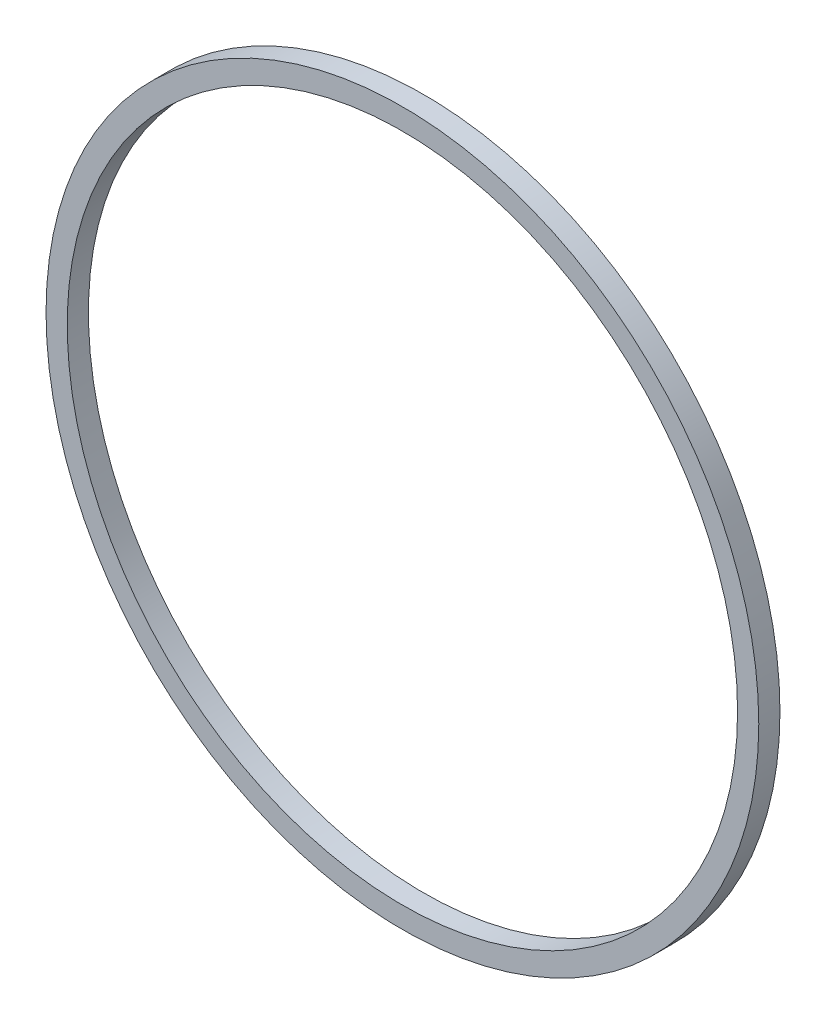
ISO-10303-21;
HEADER;
FILE_DESCRIPTION(('STEP AP214'),'2;1');
FILE_NAME('part.step','',(''),(''),'','','');
FILE_SCHEMA(('AUTOMOTIVE_DESIGN { 1 0 10303 214 1 1 1 1 }'));
ENDSEC;
DATA;
#1=APPLICATION_CONTEXT('core data for automotive mechanical design processes');
#2=APPLICATION_PROTOCOL_DEFINITION('international standard','automotive_design',2000,#1);
#3=PRODUCT_CONTEXT('',#1,'mechanical');
#4=PRODUCT('Part','Part','',(#3));
#5=PRODUCT_RELATED_PRODUCT_CATEGORY('part','',(#4));
#6=PRODUCT_DEFINITION_FORMATION('','',#4);
#7=PRODUCT_DEFINITION_CONTEXT('part definition',#1,'design');
#8=PRODUCT_DEFINITION('design','',#6,#7);
#9=PRODUCT_DEFINITION_SHAPE('','',#8);
#10=(LENGTH_UNIT() NAMED_UNIT(*) SI_UNIT(.MILLI.,.METRE.));
#11=(NAMED_UNIT(*) PLANE_ANGLE_UNIT() SI_UNIT($,.RADIAN.));
#12=(NAMED_UNIT(*) SI_UNIT($,.STERADIAN.) SOLID_ANGLE_UNIT());
#13=UNCERTAINTY_MEASURE_WITH_UNIT(LENGTH_MEASURE(1.E-05),#10,'distance_accuracy_value','');
#14=(GEOMETRIC_REPRESENTATION_CONTEXT(3) GLOBAL_UNCERTAINTY_ASSIGNED_CONTEXT((#13)) GLOBAL_UNIT_ASSIGNED_CONTEXT((#10,
#11,#12)) REPRESENTATION_CONTEXT('',''));
#15=CARTESIAN_POINT('',(0.,0.,0.));
#16=DIRECTION('',(0.,0.,1.));
#17=DIRECTION('',(1.,0.,0.));
#18=AXIS2_PLACEMENT_3D('',#15,#16,#17);
#19=CARTESIAN_POINT('',(0.,0.,1.55575));
#20=DIRECTION('',(0.,0.,1.));
#21=DIRECTION('',(1.,0.,0.));
#22=AXIS2_PLACEMENT_3D('',#19,#20,#21);
#23=PLANE('',#22);
#24=CARTESIAN_POINT('',(0.,0.,1.55575));
#25=DIRECTION('',(0.,0.,1.));
#26=DIRECTION('',(1.,0.,0.));
#27=AXIS2_PLACEMENT_3D('',#24,#25,#26);
#28=CIRCLE('',#27,26.162);
#29=CARTESIAN_POINT('',(26.162,0.,1.55575));
#30=VERTEX_POINT('',#29);
#31=EDGE_CURVE('E10',#30,#30,#28,.T.);
#32=ORIENTED_EDGE('',*,*,#31,.T.);
#33=EDGE_LOOP('',(#32));
#34=FACE_BOUND('',#33,.T.);
#35=CARTESIAN_POINT('',(0.,0.,1.55575));
#36=DIRECTION('',(0.,0.,1.));
#37=DIRECTION('',(1.,0.,0.));
#38=AXIS2_PLACEMENT_3D('',#35,#36,#37);
#39=CIRCLE('',#38,24.60625);
#40=CARTESIAN_POINT('',(24.60625,0.,1.55575));
#41=VERTEX_POINT('',#40);
#42=EDGE_CURVE('E46',#41,#41,#39,.T.);
#43=ORIENTED_EDGE('',*,*,#42,.F.);
#44=EDGE_LOOP('',(#43));
#45=FACE_BOUND('',#44,.T.);
#46=ADVANCED_FACE('F35',(#34,#45),#23,.T.);
#47=CARTESIAN_POINT('',(0.,0.,0.));
#48=DIRECTION('',(0.,0.,1.));
#49=DIRECTION('',(1.,0.,0.));
#50=AXIS2_PLACEMENT_3D('',#47,#48,#49);
#51=PLANE('',#50);
#52=CARTESIAN_POINT('',(0.,0.,0.));
#53=DIRECTION('',(0.,0.,1.));
#54=DIRECTION('',(1.,0.,0.));
#55=AXIS2_PLACEMENT_3D('',#52,#53,#54);
#56=CIRCLE('',#55,26.162);
#57=CARTESIAN_POINT('',(26.162,0.,0.));
#58=VERTEX_POINT('',#57);
#59=EDGE_CURVE('E39',#58,#58,#56,.T.);
#60=ORIENTED_EDGE('',*,*,#59,.F.);
#61=EDGE_LOOP('',(#60));
#62=FACE_BOUND('',#61,.T.);
#63=CARTESIAN_POINT('',(0.,0.,0.));
#64=DIRECTION('',(0.,0.,1.));
#65=DIRECTION('',(1.,0.,0.));
#66=AXIS2_PLACEMENT_3D('',#63,#64,#65);
#67=CIRCLE('',#66,24.60625);
#68=CARTESIAN_POINT('',(24.60625,0.,0.));
#69=VERTEX_POINT('',#68);
#70=EDGE_CURVE('E48',#69,#69,#67,.T.);
#71=ORIENTED_EDGE('',*,*,#70,.T.);
#72=EDGE_LOOP('',(#71));
#73=FACE_BOUND('',#72,.T.);
#74=ADVANCED_FACE('F58',(#62,#73),#51,.F.);
#75=CARTESIAN_POINT('',(0.,0.,1.55575));
#76=DIRECTION('',(0.,0.,-1.));
#77=DIRECTION('',(-1.,0.,0.));
#78=AXIS2_PLACEMENT_3D('',#75,#76,#77);
#79=CYLINDRICAL_SURFACE('',#78,26.162);
#80=ORIENTED_EDGE('',*,*,#31,.F.);
#81=EDGE_LOOP('',(#80));
#82=FACE_BOUND('',#81,.T.);
#83=ORIENTED_EDGE('',*,*,#59,.T.);
#84=EDGE_LOOP('',(#83));
#85=FACE_BOUND('',#84,.T.);
#86=ADVANCED_FACE('F37',(#82,#85),#79,.T.);
#87=CARTESIAN_POINT('',(0.,0.,1.55575));
#88=DIRECTION('',(0.,0.,-1.));
#89=DIRECTION('',(-1.,0.,0.));
#90=AXIS2_PLACEMENT_3D('',#87,#88,#89);
#91=CYLINDRICAL_SURFACE('',#90,24.60625);
#92=ORIENTED_EDGE('',*,*,#42,.T.);
#93=EDGE_LOOP('',(#92));
#94=FACE_BOUND('',#93,.T.);
#95=ORIENTED_EDGE('',*,*,#70,.F.);
#96=EDGE_LOOP('',(#95));
#97=FACE_BOUND('',#96,.T.);
#98=ADVANCED_FACE('F54',(#94,#97),#91,.F.);
#99=CLOSED_SHELL('',(#46,#74,#86,#98));
#100=MANIFOLD_SOLID_BREP('B2',#99);
#101=ADVANCED_BREP_SHAPE_REPRESENTATION('',(#18,#100),#14);
#102=SHAPE_DEFINITION_REPRESENTATION(#9,#101);
ENDSEC;
END-ISO-10303-21;
